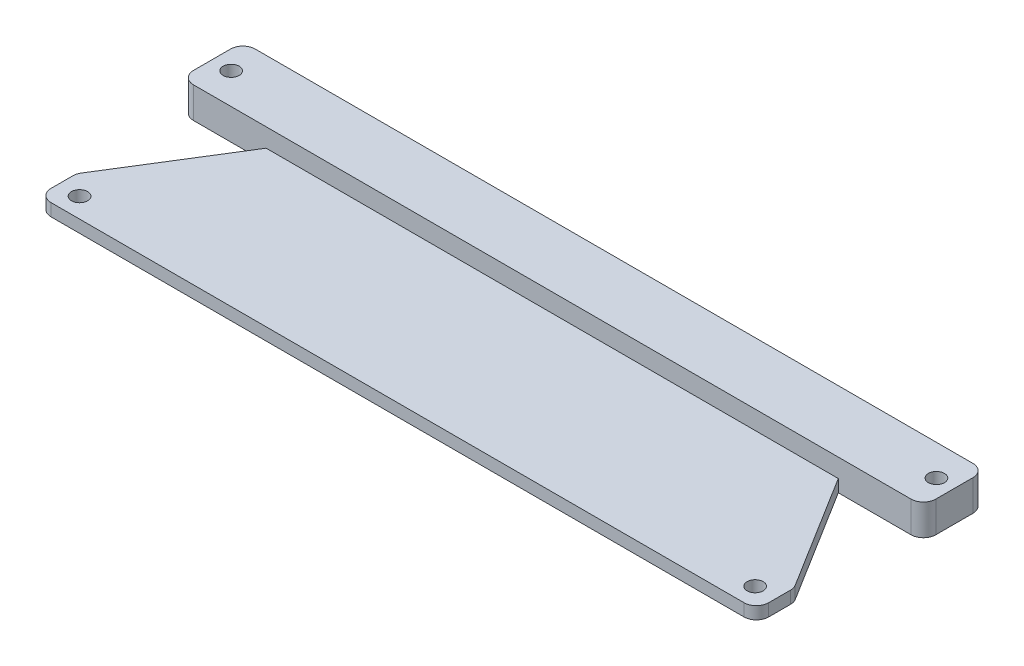
ISO-10303-21;
HEADER;
FILE_DESCRIPTION(('STEP AP214'),'2;1');
FILE_NAME('part.step','',(''),(''),'','','');
FILE_SCHEMA(('AUTOMOTIVE_DESIGN { 1 0 10303 214 1 1 1 1 }'));
ENDSEC;
DATA;
#1=APPLICATION_CONTEXT('core data for automotive mechanical design processes');
#2=APPLICATION_PROTOCOL_DEFINITION('international standard','automotive_design',2000,#1);
#3=PRODUCT_CONTEXT('',#1,'mechanical');
#4=PRODUCT('Part','Part','',(#3));
#5=PRODUCT_RELATED_PRODUCT_CATEGORY('part','',(#4));
#6=PRODUCT_DEFINITION_FORMATION('','',#4);
#7=PRODUCT_DEFINITION_CONTEXT('part definition',#1,'design');
#8=PRODUCT_DEFINITION('design','',#6,#7);
#9=PRODUCT_DEFINITION_SHAPE('','',#8);
#10=(LENGTH_UNIT() NAMED_UNIT(*) SI_UNIT(.MILLI.,.METRE.));
#11=(NAMED_UNIT(*) PLANE_ANGLE_UNIT() SI_UNIT($,.RADIAN.));
#12=(NAMED_UNIT(*) SI_UNIT($,.STERADIAN.) SOLID_ANGLE_UNIT());
#13=UNCERTAINTY_MEASURE_WITH_UNIT(LENGTH_MEASURE(1.E-05),#10,'distance_accuracy_value','');
#14=(GEOMETRIC_REPRESENTATION_CONTEXT(3) GLOBAL_UNCERTAINTY_ASSIGNED_CONTEXT((#13)) GLOBAL_UNIT_ASSIGNED_CONTEXT((#10,
#11,#12)) REPRESENTATION_CONTEXT('',''));
#15=CARTESIAN_POINT('',(0.,0.,0.));
#16=DIRECTION('',(0.,0.,1.));
#17=DIRECTION('',(1.,0.,0.));
#18=AXIS2_PLACEMENT_3D('',#15,#16,#17);
#19=CARTESIAN_POINT('',(0.,0.,0.));
#20=DIRECTION('',(0.,-1.,0.));
#21=DIRECTION('',(-1.,0.,0.));
#22=AXIS2_PLACEMENT_3D('',#19,#20,#21);
#23=PLANE('',#22);
#24=CARTESIAN_POINT('',(69.342,0.,40.386));
#25=DIRECTION('',(0.,-1.,0.));
#26=DIRECTION('',(0.,0.,1.));
#27=AXIS2_PLACEMENT_3D('',#24,#25,#26);
#28=CIRCLE('',#27,1.65100000000001);
#29=CARTESIAN_POINT('',(69.342,0.,42.037));
#30=VERTEX_POINT('',#29);
#31=EDGE_CURVE('E610',#30,#30,#28,.T.);
#32=ORIENTED_EDGE('',*,*,#31,.F.);
#33=EDGE_LOOP('',(#32));
#34=FACE_BOUND('',#33,.T.);
#35=CARTESIAN_POINT('',(-69.342,0.,40.386));
#36=DIRECTION('',(0.,1.,0.));
#37=DIRECTION('',(0.,0.,1.));
#38=AXIS2_PLACEMENT_3D('',#35,#36,#37);
#39=CIRCLE('',#38,1.65100000000001);
#40=CARTESIAN_POINT('',(-69.342,0.,42.037));
#41=VERTEX_POINT('',#40);
#42=EDGE_CURVE('E330',#41,#41,#39,.T.);
#43=ORIENTED_EDGE('',*,*,#42,.T.);
#44=EDGE_LOOP('',(#43));
#45=FACE_BOUND('',#44,.T.);
#46=DIRECTION('',(0.,0.,-1.));
#47=VECTOR('',#46,1.);
#48=CARTESIAN_POINT('',(-73.66,0.,44.45));
#49=LINE('',#48,#47);
#50=CARTESIAN_POINT('',(-73.66,0.,41.91));
#51=VERTEX_POINT('',#50);
#52=CARTESIAN_POINT('',(-73.66,0.,37.4301723546728));
#53=VERTEX_POINT('',#52);
#54=EDGE_CURVE('E202',#51,#53,#49,.T.);
#55=ORIENTED_EDGE('',*,*,#54,.T.);
#56=CARTESIAN_POINT('',(-71.12,0.,37.4301723546728));
#57=DIRECTION('',(0.,-1.,0.));
#58=DIRECTION('',(0.,0.,-1.));
#59=AXIS2_PLACEMENT_3D('',#56,#57,#58);
#60=CIRCLE('',#59,2.54);
#61=CARTESIAN_POINT('',(-73.2767480477236,0.,36.0885174591649));
#62=VERTEX_POINT('',#61);
#63=EDGE_CURVE('E293',#53,#62,#60,.T.);
#64=ORIENTED_EDGE('',*,*,#63,.T.);
#65=DIRECTION('',(-0.528210588782656,0.,0.849113404615591));
#66=VECTOR('',#65,1.);
#67=CARTESIAN_POINT('',(-58.7273810129965,0.,12.7));
#68=LINE('',#67,#66);
#69=CARTESIAN_POINT('',(-58.7273810129965,0.,12.7));
#70=VERTEX_POINT('',#69);
#71=EDGE_CURVE('E189',#70,#62,#68,.T.);
#72=ORIENTED_EDGE('',*,*,#71,.F.);
#73=DIRECTION('',(1.,0.,0.));
#74=VECTOR('',#73,1.);
#75=CARTESIAN_POINT('',(-73.66,0.,12.7));
#76=LINE('',#75,#74);
#77=CARTESIAN_POINT('',(-73.66,0.,12.7));
#78=VERTEX_POINT('',#77);
#79=EDGE_CURVE('E177',#78,#70,#76,.T.);
#80=ORIENTED_EDGE('',*,*,#79,.F.);
#81=CARTESIAN_POINT('',(-73.66,0.,10.16));
#82=DIRECTION('',(0.,-1.,0.));
#83=DIRECTION('',(0.,0.,-1.));
#84=AXIS2_PLACEMENT_3D('',#81,#82,#83);
#85=CIRCLE('',#84,2.54);
#86=CARTESIAN_POINT('',(-76.2,0.,10.16));
#87=VERTEX_POINT('',#86);
#88=EDGE_CURVE('E252',#78,#87,#85,.T.);
#89=ORIENTED_EDGE('',*,*,#88,.T.);
#90=DIRECTION('',(0.,0.,-1.));
#91=VECTOR('',#90,1.);
#92=CARTESIAN_POINT('',(-76.2,0.,12.7));
#93=LINE('',#92,#91);
#94=CARTESIAN_POINT('',(-76.2,0.,2.54));
#95=VERTEX_POINT('',#94);
#96=EDGE_CURVE('E229',#87,#95,#93,.T.);
#97=ORIENTED_EDGE('',*,*,#96,.T.);
#98=CARTESIAN_POINT('',(-73.66,0.,2.54));
#99=DIRECTION('',(0.,-1.,0.));
#100=DIRECTION('',(0.,0.,-1.));
#101=AXIS2_PLACEMENT_3D('',#98,#99,#100);
#102=CIRCLE('',#101,2.54);
#103=CARTESIAN_POINT('',(-73.66,0.,0.));
#104=VERTEX_POINT('',#103);
#105=EDGE_CURVE('E250',#95,#104,#102,.T.);
#106=ORIENTED_EDGE('',*,*,#105,.T.);
#107=DIRECTION('',(1.,0.,0.));
#108=VECTOR('',#107,1.);
#109=CARTESIAN_POINT('',(-76.2,0.,0.));
#110=LINE('',#109,#108);
#111=CARTESIAN_POINT('',(73.6599999999999,0.,0.));
#112=VERTEX_POINT('',#111);
#113=EDGE_CURVE('E241',#104,#112,#110,.T.);
#114=ORIENTED_EDGE('',*,*,#113,.T.);
#115=CARTESIAN_POINT('',(73.66,0.,2.53999999999997));
#116=DIRECTION('',(0.,-1.,0.));
#117=DIRECTION('',(0.,0.,-1.));
#118=AXIS2_PLACEMENT_3D('',#115,#116,#117);
#119=CIRCLE('',#118,2.54);
#120=CARTESIAN_POINT('',(76.2,0.,2.53999999999997));
#121=VERTEX_POINT('',#120);
#122=EDGE_CURVE('E254',#112,#121,#119,.T.);
#123=ORIENTED_EDGE('',*,*,#122,.T.);
#124=DIRECTION('',(0.,0.,1.));
#125=VECTOR('',#124,1.);
#126=CARTESIAN_POINT('',(76.2,0.,0.));
#127=LINE('',#126,#125);
#128=CARTESIAN_POINT('',(76.2,0.,10.16));
#129=VERTEX_POINT('',#128);
#130=EDGE_CURVE('E222',#121,#129,#127,.T.);
#131=ORIENTED_EDGE('',*,*,#130,.T.);
#132=CARTESIAN_POINT('',(73.66,0.,10.16));
#133=DIRECTION('',(0.,-1.,0.));
#134=DIRECTION('',(0.,0.,-1.));
#135=AXIS2_PLACEMENT_3D('',#132,#133,#134);
#136=CIRCLE('',#135,2.54);
#137=CARTESIAN_POINT('',(73.66,0.,12.7));
#138=VERTEX_POINT('',#137);
#139=EDGE_CURVE('E256',#129,#138,#136,.T.);
#140=ORIENTED_EDGE('',*,*,#139,.T.);
#141=DIRECTION('',(-1.,0.,0.));
#142=VECTOR('',#141,1.);
#143=CARTESIAN_POINT('',(73.66,0.,12.7));
#144=LINE('',#143,#142);
#145=CARTESIAN_POINT('',(58.7273810129965,0.,12.7));
#146=VERTEX_POINT('',#145);
#147=EDGE_CURVE('E334',#138,#146,#144,.T.);
#148=ORIENTED_EDGE('',*,*,#147,.T.);
#149=DIRECTION('',(0.528210588782656,0.,0.849113404615591));
#150=VECTOR('',#149,1.);
#151=CARTESIAN_POINT('',(58.7273810129965,0.,12.7));
#152=LINE('',#151,#150);
#153=CARTESIAN_POINT('',(73.2767480477236,0.,36.0885174591649));
#154=VERTEX_POINT('',#153);
#155=EDGE_CURVE('E181',#146,#154,#152,.T.);
#156=ORIENTED_EDGE('',*,*,#155,.T.);
#157=CARTESIAN_POINT('',(71.12,0.,37.4301723546728));
#158=DIRECTION('',(0.,-1.,0.));
#159=DIRECTION('',(0.,0.,-1.));
#160=AXIS2_PLACEMENT_3D('',#157,#158,#159);
#161=CIRCLE('',#160,2.54);
#162=CARTESIAN_POINT('',(73.66,0.,37.4301723546728));
#163=VERTEX_POINT('',#162);
#164=EDGE_CURVE('E291',#154,#163,#161,.T.);
#165=ORIENTED_EDGE('',*,*,#164,.T.);
#166=DIRECTION('',(0.,0.,-1.));
#167=VECTOR('',#166,1.);
#168=CARTESIAN_POINT('',(73.66,0.,44.45));
#169=LINE('',#168,#167);
#170=CARTESIAN_POINT('',(73.66,0.,41.91));
#171=VERTEX_POINT('',#170);
#172=EDGE_CURVE('E210',#171,#163,#169,.T.);
#173=ORIENTED_EDGE('',*,*,#172,.F.);
#174=CARTESIAN_POINT('',(71.12,0.,41.91));
#175=DIRECTION('',(0.,-1.,0.));
#176=DIRECTION('',(0.,0.,-1.));
#177=AXIS2_PLACEMENT_3D('',#174,#175,#176);
#178=CIRCLE('',#177,2.54);
#179=CARTESIAN_POINT('',(71.12,0.,44.45));
#180=VERTEX_POINT('',#179);
#181=EDGE_CURVE('E289',#171,#180,#178,.T.);
#182=ORIENTED_EDGE('',*,*,#181,.T.);
#183=DIRECTION('',(1.,0.,0.));
#184=VECTOR('',#183,1.);
#185=CARTESIAN_POINT('',(-73.66,0.,44.45));
#186=LINE('',#185,#184);
#187=CARTESIAN_POINT('',(-71.12,0.,44.45));
#188=VERTEX_POINT('',#187);
#189=EDGE_CURVE('E193',#188,#180,#186,.T.);
#190=ORIENTED_EDGE('',*,*,#189,.F.);
#191=CARTESIAN_POINT('',(-71.12,0.,41.91));
#192=DIRECTION('',(0.,-1.,0.));
#193=DIRECTION('',(0.,0.,-1.));
#194=AXIS2_PLACEMENT_3D('',#191,#192,#193);
#195=CIRCLE('',#194,2.54);
#196=EDGE_CURVE('E287',#188,#51,#195,.T.);
#197=ORIENTED_EDGE('',*,*,#196,.T.);
#198=EDGE_LOOP('',(#55,#64,#72,#80,#89,#97,#106,#114,#123,#131,#140,#148,#156,#165,#173,#182,
#190,#197));
#199=FACE_BOUND('',#198,.T.);
#200=CARTESIAN_POINT('',(-72.259949664643,0.,6.35));
#201=DIRECTION('',(0.,1.,0.));
#202=DIRECTION('',(0.,0.,1.));
#203=AXIS2_PLACEMENT_3D('',#200,#201,#202);
#204=CIRCLE('',#203,1.65100000000001);
#205=CARTESIAN_POINT('',(-72.259949664643,0.,8.001));
#206=VERTEX_POINT('',#205);
#207=EDGE_CURVE('E213',#206,#206,#204,.T.);
#208=ORIENTED_EDGE('',*,*,#207,.T.);
#209=EDGE_LOOP('',(#208));
#210=FACE_BOUND('',#209,.T.);
#211=CARTESIAN_POINT('',(72.5200503353569,0.,6.34999999999997));
#212=DIRECTION('',(0.,1.,0.));
#213=DIRECTION('',(0.,0.,1.));
#214=AXIS2_PLACEMENT_3D('',#211,#212,#213);
#215=CIRCLE('',#214,1.65100000000001);
#216=CARTESIAN_POINT('',(72.5200503353569,0.,8.00099999999998));
#217=VERTEX_POINT('',#216);
#218=EDGE_CURVE('E219',#217,#217,#215,.T.);
#219=ORIENTED_EDGE('',*,*,#218,.T.);
#220=EDGE_LOOP('',(#219));
#221=FACE_BOUND('',#220,.T.);
#222=ADVANCED_FACE('F44',(#34,#45,#199,#210,#221),#23,.T.);
#223=CARTESIAN_POINT('',(73.66,2.54,44.45));
#224=DIRECTION('',(1.,0.,0.));
#225=DIRECTION('',(0.,1.,0.));
#226=AXIS2_PLACEMENT_3D('',#223,#224,#225);
#227=PLANE('',#226);
#228=ORIENTED_EDGE('',*,*,#172,.T.);
#229=DIRECTION('',(0.,-1.,0.));
#230=VECTOR('',#229,1.);
#231=CARTESIAN_POINT('',(73.66,2.54000000000006,37.4301723546728));
#232=LINE('',#231,#230);
#233=CARTESIAN_POINT('',(73.66,2.54,37.4301723546728));
#234=VERTEX_POINT('',#233);
#235=EDGE_CURVE('E67',#163,#234,#232,.F.);
#236=ORIENTED_EDGE('',*,*,#235,.T.);
#237=DIRECTION('',(0.,0.,-1.));
#238=VECTOR('',#237,1.);
#239=CARTESIAN_POINT('',(73.66,2.54,44.45));
#240=LINE('',#239,#238);
#241=CARTESIAN_POINT('',(73.66,2.54,41.91));
#242=VERTEX_POINT('',#241);
#243=EDGE_CURVE('E208',#242,#234,#240,.T.);
#244=ORIENTED_EDGE('',*,*,#243,.F.);
#245=DIRECTION('',(0.,-1.,0.));
#246=VECTOR('',#245,1.);
#247=CARTESIAN_POINT('',(73.66,0.,41.91));
#248=LINE('',#247,#246);
#249=EDGE_CURVE('E306',#242,#171,#248,.T.);
#250=ORIENTED_EDGE('',*,*,#249,.T.);
#251=EDGE_LOOP('',(#228,#236,#244,#250));
#252=FACE_BOUND('',#251,.T.);
#253=ADVANCED_FACE('F346',(#252),#227,.T.);
#254=CARTESIAN_POINT('',(-73.66,2.54,44.45));
#255=DIRECTION('',(0.,1.,0.));
#256=DIRECTION('',(0.,0.,1.));
#257=AXIS2_PLACEMENT_3D('',#254,#255,#256);
#258=PLANE('',#257);
#259=CARTESIAN_POINT('',(69.342,2.54,40.386));
#260=DIRECTION('',(0.,-1.,0.));
#261=DIRECTION('',(0.,0.,1.));
#262=AXIS2_PLACEMENT_3D('',#259,#260,#261);
#263=CIRCLE('',#262,1.65100000000001);
#264=CARTESIAN_POINT('',(69.342,2.54,42.037));
#265=VERTEX_POINT('',#264);
#266=EDGE_CURVE('E614',#265,#265,#263,.T.);
#267=ORIENTED_EDGE('',*,*,#266,.T.);
#268=EDGE_LOOP('',(#267));
#269=FACE_BOUND('',#268,.T.);
#270=CARTESIAN_POINT('',(-69.342,2.54,40.386));
#271=DIRECTION('',(0.,1.,0.));
#272=DIRECTION('',(0.,0.,1.));
#273=AXIS2_PLACEMENT_3D('',#270,#271,#272);
#274=CIRCLE('',#273,1.65100000000001);
#275=CARTESIAN_POINT('',(-69.342,2.54,42.037));
#276=VERTEX_POINT('',#275);
#277=EDGE_CURVE('E608',#276,#276,#274,.T.);
#278=ORIENTED_EDGE('',*,*,#277,.F.);
#279=EDGE_LOOP('',(#278));
#280=FACE_BOUND('',#279,.T.);
#281=DIRECTION('',(-0.528210588782656,0.,0.849113404615591));
#282=VECTOR('',#281,1.);
#283=CARTESIAN_POINT('',(-58.7273810129965,2.54,12.7));
#284=LINE('',#283,#282);
#285=CARTESIAN_POINT('',(-58.7273810129965,2.54,12.7));
#286=VERTEX_POINT('',#285);
#287=CARTESIAN_POINT('',(-73.2767480477236,2.54,36.0885174591649));
#288=VERTEX_POINT('',#287);
#289=EDGE_CURVE('E182',#286,#288,#284,.T.);
#290=ORIENTED_EDGE('',*,*,#289,.T.);
#291=CARTESIAN_POINT('',(-71.12,2.54,37.4301723546728));
#292=DIRECTION('',(0.,1.,0.));
#293=DIRECTION('',(0.,0.,1.));
#294=AXIS2_PLACEMENT_3D('',#291,#292,#293);
#295=CIRCLE('',#294,2.54);
#296=CARTESIAN_POINT('',(-73.66,2.54,37.4301723546728));
#297=VERTEX_POINT('',#296);
#298=EDGE_CURVE('E301',#288,#297,#295,.T.);
#299=ORIENTED_EDGE('',*,*,#298,.T.);
#300=DIRECTION('',(0.,0.,-1.));
#301=VECTOR('',#300,1.);
#302=CARTESIAN_POINT('',(-73.66,2.54,44.45));
#303=LINE('',#302,#301);
#304=CARTESIAN_POINT('',(-73.66,2.54,41.91));
#305=VERTEX_POINT('',#304);
#306=EDGE_CURVE('E205',#305,#297,#303,.T.);
#307=ORIENTED_EDGE('',*,*,#306,.F.);
#308=CARTESIAN_POINT('',(-71.12,2.54,41.91));
#309=DIRECTION('',(0.,1.,0.));
#310=DIRECTION('',(0.,0.,1.));
#311=AXIS2_PLACEMENT_3D('',#308,#309,#310);
#312=CIRCLE('',#311,2.54);
#313=CARTESIAN_POINT('',(-71.12,2.54,44.45));
#314=VERTEX_POINT('',#313);
#315=EDGE_CURVE('E296',#305,#314,#312,.T.);
#316=ORIENTED_EDGE('',*,*,#315,.T.);
#317=DIRECTION('',(1.,0.,0.));
#318=VECTOR('',#317,1.);
#319=CARTESIAN_POINT('',(-73.66,2.54,44.45));
#320=LINE('',#319,#318);
#321=CARTESIAN_POINT('',(71.12,2.54,44.45));
#322=VERTEX_POINT('',#321);
#323=EDGE_CURVE('E197',#314,#322,#320,.T.);
#324=ORIENTED_EDGE('',*,*,#323,.T.);
#325=CARTESIAN_POINT('',(71.12,2.54,41.91));
#326=DIRECTION('',(0.,1.,0.));
#327=DIRECTION('',(0.,0.,1.));
#328=AXIS2_PLACEMENT_3D('',#325,#326,#327);
#329=CIRCLE('',#328,2.54);
#330=EDGE_CURVE('E298',#322,#242,#329,.T.);
#331=ORIENTED_EDGE('',*,*,#330,.T.);
#332=ORIENTED_EDGE('',*,*,#243,.T.);
#333=CARTESIAN_POINT('',(71.12,2.54,37.4301723546728));
#334=DIRECTION('',(0.,1.,0.));
#335=DIRECTION('',(0.,0.,1.));
#336=AXIS2_PLACEMENT_3D('',#333,#334,#335);
#337=CIRCLE('',#336,2.54);
#338=CARTESIAN_POINT('',(73.2767480477236,2.54,36.0885174591649));
#339=VERTEX_POINT('',#338);
#340=EDGE_CURVE('E59',#234,#339,#337,.T.);
#341=ORIENTED_EDGE('',*,*,#340,.T.);
#342=DIRECTION('',(0.528210588782656,0.,0.849113404615591));
#343=VECTOR('',#342,1.);
#344=CARTESIAN_POINT('',(58.7273810129965,2.54,12.7));
#345=LINE('',#344,#343);
#346=CARTESIAN_POINT('',(58.7273810129965,2.54,12.7));
#347=VERTEX_POINT('',#346);
#348=EDGE_CURVE('E192',#347,#339,#345,.T.);
#349=ORIENTED_EDGE('',*,*,#348,.F.);
#350=DIRECTION('',(1.,0.,0.));
#351=VECTOR('',#350,1.);
#352=CARTESIAN_POINT('',(-73.66,2.54,12.7));
#353=LINE('',#352,#351);
#354=EDGE_CURVE('E174',#286,#347,#353,.T.);
#355=ORIENTED_EDGE('',*,*,#354,.F.);
#356=EDGE_LOOP('',(#290,#299,#307,#316,#324,#331,#332,#341,#349,#355));
#357=FACE_BOUND('',#356,.T.);
#358=ADVANCED_FACE('F191',(#269,#280,#357),#258,.T.);
#359=CARTESIAN_POINT('',(-76.2,6.35,12.7));
#360=DIRECTION('',(0.,0.,-1.));
#361=DIRECTION('',(-1.,0.,0.));
#362=AXIS2_PLACEMENT_3D('',#359,#360,#361);
#363=PLANE('',#362);
#364=DIRECTION('',(0.,-1.,0.));
#365=VECTOR('',#364,1.);
#366=CARTESIAN_POINT('',(-73.66,0.,12.7));
#367=LINE('',#366,#365);
#368=CARTESIAN_POINT('',(-73.66,6.35,12.7));
#369=VERTEX_POINT('',#368);
#370=EDGE_CURVE('E259',#369,#78,#367,.T.);
#371=ORIENTED_EDGE('',*,*,#370,.T.);
#372=ORIENTED_EDGE('',*,*,#79,.T.);
#373=DIRECTION('',(0.,-1.,0.));
#374=VECTOR('',#373,1.);
#375=CARTESIAN_POINT('',(-58.7273810129965,2.54,12.7));
#376=LINE('',#375,#374);
#377=EDGE_CURVE('E170',#286,#70,#376,.T.);
#378=ORIENTED_EDGE('',*,*,#377,.F.);
#379=ORIENTED_EDGE('',*,*,#354,.T.);
#380=DIRECTION('',(0.,-1.,0.));
#381=VECTOR('',#380,1.);
#382=CARTESIAN_POINT('',(58.7273810129965,2.54,12.7));
#383=LINE('',#382,#381);
#384=EDGE_CURVE('E194',#347,#146,#383,.T.);
#385=ORIENTED_EDGE('',*,*,#384,.T.);
#386=ORIENTED_EDGE('',*,*,#147,.F.);
#387=DIRECTION('',(0.,-1.,0.));
#388=VECTOR('',#387,1.);
#389=CARTESIAN_POINT('',(73.66,6.35,12.7));
#390=LINE('',#389,#388);
#391=CARTESIAN_POINT('',(73.66,6.35,12.7));
#392=VERTEX_POINT('',#391);
#393=EDGE_CURVE('E261',#138,#392,#390,.F.);
#394=ORIENTED_EDGE('',*,*,#393,.T.);
#395=DIRECTION('',(1.,0.,0.));
#396=VECTOR('',#395,1.);
#397=CARTESIAN_POINT('',(-76.2,6.35,12.7));
#398=LINE('',#397,#396);
#399=EDGE_CURVE('E225',#369,#392,#398,.T.);
#400=ORIENTED_EDGE('',*,*,#399,.F.);
#401=EDGE_LOOP('',(#371,#372,#378,#379,#385,#386,#394,#400));
#402=FACE_BOUND('',#401,.T.);
#403=ADVANCED_FACE('F172',(#402),#363,.F.);
#404=CARTESIAN_POINT('',(76.2,6.35,0.));
#405=DIRECTION('',(1.,0.,0.));
#406=DIRECTION('',(0.,0.,-1.));
#407=AXIS2_PLACEMENT_3D('',#404,#405,#406);
#408=PLANE('',#407);
#409=DIRECTION('',(0.,0.,1.));
#410=VECTOR('',#409,1.);
#411=CARTESIAN_POINT('',(76.2,6.35,0.));
#412=LINE('',#411,#410);
#413=CARTESIAN_POINT('',(76.2,6.35,2.53999999999997));
#414=VERTEX_POINT('',#413);
#415=CARTESIAN_POINT('',(76.2,6.35,10.16));
#416=VERTEX_POINT('',#415);
#417=EDGE_CURVE('E228',#414,#416,#412,.T.);
#418=ORIENTED_EDGE('',*,*,#417,.T.);
#419=DIRECTION('',(0.,-1.,0.));
#420=VECTOR('',#419,1.);
#421=CARTESIAN_POINT('',(76.2,0.,10.16));
#422=LINE('',#421,#420);
#423=EDGE_CURVE('E247',#416,#129,#422,.T.);
#424=ORIENTED_EDGE('',*,*,#423,.T.);
#425=ORIENTED_EDGE('',*,*,#130,.F.);
#426=DIRECTION('',(0.,-1.,0.));
#427=VECTOR('',#426,1.);
#428=CARTESIAN_POINT('',(76.2,6.35,2.53999999999997));
#429=LINE('',#428,#427);
#430=EDGE_CURVE('E238',#121,#414,#429,.F.);
#431=ORIENTED_EDGE('',*,*,#430,.T.);
#432=EDGE_LOOP('',(#418,#424,#425,#431));
#433=FACE_BOUND('',#432,.T.);
#434=ADVANCED_FACE('F380',(#433),#408,.T.);
#435=CARTESIAN_POINT('',(-76.2,6.35,0.));
#436=DIRECTION('',(0.,0.,-1.));
#437=DIRECTION('',(-1.,0.,0.));
#438=AXIS2_PLACEMENT_3D('',#435,#436,#437);
#439=PLANE('',#438);
#440=DIRECTION('',(1.,0.,0.));
#441=VECTOR('',#440,1.);
#442=CARTESIAN_POINT('',(-76.2,6.35,0.));
#443=LINE('',#442,#441);
#444=CARTESIAN_POINT('',(-73.66,6.35,0.));
#445=VERTEX_POINT('',#444);
#446=CARTESIAN_POINT('',(73.6599999999999,6.35,0.));
#447=VERTEX_POINT('',#446);
#448=EDGE_CURVE('E232',#445,#447,#443,.T.);
#449=ORIENTED_EDGE('',*,*,#448,.T.);
#450=DIRECTION('',(0.,-1.,0.));
#451=VECTOR('',#450,1.);
#452=CARTESIAN_POINT('',(73.66,6.35,0.));
#453=LINE('',#452,#451);
#454=EDGE_CURVE('E273',#447,#112,#453,.T.);
#455=ORIENTED_EDGE('',*,*,#454,.T.);
#456=ORIENTED_EDGE('',*,*,#113,.F.);
#457=DIRECTION('',(0.,-1.,0.));
#458=VECTOR('',#457,1.);
#459=CARTESIAN_POINT('',(-73.66,6.35,0.));
#460=LINE('',#459,#458);
#461=EDGE_CURVE('E271',#104,#445,#460,.F.);
#462=ORIENTED_EDGE('',*,*,#461,.T.);
#463=EDGE_LOOP('',(#449,#455,#456,#462));
#464=FACE_BOUND('',#463,.T.);
#465=ADVANCED_FACE('F376',(#464),#439,.T.);
#466=CARTESIAN_POINT('',(-76.2,6.35,12.7));
#467=DIRECTION('',(-1.,0.,0.));
#468=DIRECTION('',(0.,0.,1.));
#469=AXIS2_PLACEMENT_3D('',#466,#467,#468);
#470=PLANE('',#469);
#471=ORIENTED_EDGE('',*,*,#96,.F.);
#472=DIRECTION('',(0.,-1.,0.));
#473=VECTOR('',#472,1.);
#474=CARTESIAN_POINT('',(-76.2,6.35,10.16));
#475=LINE('',#474,#473);
#476=CARTESIAN_POINT('',(-76.2,6.35,10.16));
#477=VERTEX_POINT('',#476);
#478=EDGE_CURVE('E279',#87,#477,#475,.F.);
#479=ORIENTED_EDGE('',*,*,#478,.T.);
#480=DIRECTION('',(0.,0.,-1.));
#481=VECTOR('',#480,1.);
#482=CARTESIAN_POINT('',(-76.2,6.35,12.7));
#483=LINE('',#482,#481);
#484=CARTESIAN_POINT('',(-76.2,6.35,2.54));
#485=VERTEX_POINT('',#484);
#486=EDGE_CURVE('E235',#477,#485,#483,.T.);
#487=ORIENTED_EDGE('',*,*,#486,.T.);
#488=DIRECTION('',(0.,-1.,0.));
#489=VECTOR('',#488,1.);
#490=CARTESIAN_POINT('',(-76.2,6.35,2.54));
#491=LINE('',#490,#489);
#492=EDGE_CURVE('E276',#485,#95,#491,.T.);
#493=ORIENTED_EDGE('',*,*,#492,.T.);
#494=EDGE_LOOP('',(#471,#479,#487,#493));
#495=FACE_BOUND('',#494,.T.);
#496=ADVANCED_FACE('F373',(#495),#470,.T.);
#497=CARTESIAN_POINT('',(0.,6.35,0.));
#498=DIRECTION('',(0.,-1.,0.));
#499=DIRECTION('',(-1.,0.,0.));
#500=AXIS2_PLACEMENT_3D('',#497,#498,#499);
#501=PLANE('',#500);
#502=CARTESIAN_POINT('',(-72.259949664643,6.35,6.35));
#503=DIRECTION('',(0.,1.,0.));
#504=DIRECTION('',(0.,0.,1.));
#505=AXIS2_PLACEMENT_3D('',#502,#503,#504);
#506=CIRCLE('',#505,1.65100000000001);
#507=CARTESIAN_POINT('',(-72.259949664643,6.35,8.001));
#508=VERTEX_POINT('',#507);
#509=EDGE_CURVE('E212',#508,#508,#506,.T.);
#510=ORIENTED_EDGE('',*,*,#509,.F.);
#511=EDGE_LOOP('',(#510));
#512=FACE_BOUND('',#511,.T.);
#513=CARTESIAN_POINT('',(72.5200503353569,6.35,6.34999999999997));
#514=DIRECTION('',(0.,1.,0.));
#515=DIRECTION('',(0.,0.,1.));
#516=AXIS2_PLACEMENT_3D('',#513,#514,#515);
#517=CIRCLE('',#516,1.65100000000001);
#518=CARTESIAN_POINT('',(72.5200503353569,6.35,8.00099999999998));
#519=VERTEX_POINT('',#518);
#520=EDGE_CURVE('E216',#519,#519,#517,.T.);
#521=ORIENTED_EDGE('',*,*,#520,.F.);
#522=EDGE_LOOP('',(#521));
#523=FACE_BOUND('',#522,.T.);
#524=ORIENTED_EDGE('',*,*,#399,.T.);
#525=CARTESIAN_POINT('',(73.66,6.35,10.16));
#526=DIRECTION('',(0.,-1.,0.));
#527=DIRECTION('',(0.,0.,-1.));
#528=AXIS2_PLACEMENT_3D('',#525,#526,#527);
#529=CIRCLE('',#528,2.54);
#530=EDGE_CURVE('E269',#392,#416,#529,.F.);
#531=ORIENTED_EDGE('',*,*,#530,.T.);
#532=ORIENTED_EDGE('',*,*,#417,.F.);
#533=CARTESIAN_POINT('',(73.66,6.35,2.53999999999997));
#534=DIRECTION('',(0.,-1.,0.));
#535=DIRECTION('',(0.,0.,-1.));
#536=AXIS2_PLACEMENT_3D('',#533,#534,#535);
#537=CIRCLE('',#536,2.54);
#538=EDGE_CURVE('E267',#414,#447,#537,.F.);
#539=ORIENTED_EDGE('',*,*,#538,.T.);
#540=ORIENTED_EDGE('',*,*,#448,.F.);
#541=CARTESIAN_POINT('',(-73.66,6.35,2.54));
#542=DIRECTION('',(0.,-1.,0.));
#543=DIRECTION('',(0.,0.,-1.));
#544=AXIS2_PLACEMENT_3D('',#541,#542,#543);
#545=CIRCLE('',#544,2.54);
#546=EDGE_CURVE('E263',#445,#485,#545,.F.);
#547=ORIENTED_EDGE('',*,*,#546,.T.);
#548=ORIENTED_EDGE('',*,*,#486,.F.);
#549=CARTESIAN_POINT('',(-73.66,6.35,10.16));
#550=DIRECTION('',(0.,-1.,0.));
#551=DIRECTION('',(0.,0.,-1.));
#552=AXIS2_PLACEMENT_3D('',#549,#550,#551);
#553=CIRCLE('',#552,2.54);
#554=EDGE_CURVE('E265',#477,#369,#553,.F.);
#555=ORIENTED_EDGE('',*,*,#554,.T.);
#556=EDGE_LOOP('',(#524,#531,#532,#539,#540,#547,#548,#555));
#557=FACE_BOUND('',#556,.T.);
#558=ADVANCED_FACE('F371',(#512,#523,#557),#501,.F.);
#559=CARTESIAN_POINT('',(73.66,6.35,10.16));
#560=DIRECTION('',(0.,1.,0.));
#561=DIRECTION('',(0.,0.,1.));
#562=AXIS2_PLACEMENT_3D('',#559,#560,#561);
#563=CYLINDRICAL_SURFACE('',#562,2.54);
#564=ORIENTED_EDGE('',*,*,#530,.F.);
#565=ORIENTED_EDGE('',*,*,#393,.F.);
#566=ORIENTED_EDGE('',*,*,#139,.F.);
#567=ORIENTED_EDGE('',*,*,#423,.F.);
#568=EDGE_LOOP('',(#564,#565,#566,#567));
#569=FACE_BOUND('',#568,.T.);
#570=ADVANCED_FACE('F387',(#569),#563,.T.);
#571=CARTESIAN_POINT('',(73.66,6.35,2.53999999999997));
#572=DIRECTION('',(0.,-1.,0.));
#573=DIRECTION('',(0.,0.,-1.));
#574=AXIS2_PLACEMENT_3D('',#571,#572,#573);
#575=CYLINDRICAL_SURFACE('',#574,2.54);
#576=ORIENTED_EDGE('',*,*,#538,.F.);
#577=ORIENTED_EDGE('',*,*,#430,.F.);
#578=ORIENTED_EDGE('',*,*,#122,.F.);
#579=ORIENTED_EDGE('',*,*,#454,.F.);
#580=EDGE_LOOP('',(#576,#577,#578,#579));
#581=FACE_BOUND('',#580,.T.);
#582=ADVANCED_FACE('F390',(#581),#575,.T.);
#583=CARTESIAN_POINT('',(-73.66,6.35,10.16));
#584=DIRECTION('',(0.,1.,0.));
#585=DIRECTION('',(0.,0.,1.));
#586=AXIS2_PLACEMENT_3D('',#583,#584,#585);
#587=CYLINDRICAL_SURFACE('',#586,2.54);
#588=ORIENTED_EDGE('',*,*,#554,.F.);
#589=ORIENTED_EDGE('',*,*,#478,.F.);
#590=ORIENTED_EDGE('',*,*,#88,.F.);
#591=ORIENTED_EDGE('',*,*,#370,.F.);
#592=EDGE_LOOP('',(#588,#589,#590,#591));
#593=FACE_BOUND('',#592,.T.);
#594=ADVANCED_FACE('F394',(#593),#587,.T.);
#595=CARTESIAN_POINT('',(-73.66,6.35,2.54));
#596=DIRECTION('',(0.,-1.,0.));
#597=DIRECTION('',(0.,0.,-1.));
#598=AXIS2_PLACEMENT_3D('',#595,#596,#597);
#599=CYLINDRICAL_SURFACE('',#598,2.54);
#600=ORIENTED_EDGE('',*,*,#546,.F.);
#601=ORIENTED_EDGE('',*,*,#461,.F.);
#602=ORIENTED_EDGE('',*,*,#105,.F.);
#603=ORIENTED_EDGE('',*,*,#492,.F.);
#604=EDGE_LOOP('',(#600,#601,#602,#603));
#605=FACE_BOUND('',#604,.T.);
#606=ADVANCED_FACE('F398',(#605),#599,.T.);
#607=CARTESIAN_POINT('',(72.5200503353569,0.,6.34999999999997));
#608=DIRECTION('',(0.,1.,0.));
#609=DIRECTION('',(0.,0.,1.));
#610=AXIS2_PLACEMENT_3D('',#607,#608,#609);
#611=CYLINDRICAL_SURFACE('',#610,1.65100000000001);
#612=ORIENTED_EDGE('',*,*,#218,.F.);
#613=EDGE_LOOP('',(#612));
#614=FACE_BOUND('',#613,.T.);
#615=ORIENTED_EDGE('',*,*,#520,.T.);
#616=EDGE_LOOP('',(#615));
#617=FACE_BOUND('',#616,.T.);
#618=ADVANCED_FACE('F402',(#614,#617),#611,.F.);
#619=CARTESIAN_POINT('',(-72.259949664643,0.,6.35));
#620=DIRECTION('',(0.,1.,0.));
#621=DIRECTION('',(0.,0.,1.));
#622=AXIS2_PLACEMENT_3D('',#619,#620,#621);
#623=CYLINDRICAL_SURFACE('',#622,1.65100000000001);
#624=ORIENTED_EDGE('',*,*,#207,.F.);
#625=EDGE_LOOP('',(#624));
#626=FACE_BOUND('',#625,.T.);
#627=ORIENTED_EDGE('',*,*,#509,.T.);
#628=EDGE_LOOP('',(#627));
#629=FACE_BOUND('',#628,.T.);
#630=ADVANCED_FACE('F420',(#626,#629),#623,.F.);
#631=CARTESIAN_POINT('',(-73.66,0.,44.45));
#632=DIRECTION('',(-1.,0.,0.));
#633=DIRECTION('',(0.,0.,1.));
#634=AXIS2_PLACEMENT_3D('',#631,#632,#633);
#635=PLANE('',#634);
#636=ORIENTED_EDGE('',*,*,#306,.T.);
#637=DIRECTION('',(0.,-1.,0.));
#638=VECTOR('',#637,1.);
#639=CARTESIAN_POINT('',(-73.66,0.,37.4301723546728));
#640=LINE('',#639,#638);
#641=EDGE_CURVE('E284',#297,#53,#640,.T.);
#642=ORIENTED_EDGE('',*,*,#641,.T.);
#643=ORIENTED_EDGE('',*,*,#54,.F.);
#644=DIRECTION('',(0.,1.,0.));
#645=VECTOR('',#644,1.);
#646=CARTESIAN_POINT('',(-73.66,2.54,41.91));
#647=LINE('',#646,#645);
#648=EDGE_CURVE('E281',#51,#305,#647,.T.);
#649=ORIENTED_EDGE('',*,*,#648,.T.);
#650=EDGE_LOOP('',(#636,#642,#643,#649));
#651=FACE_BOUND('',#650,.T.);
#652=ADVANCED_FACE('F325',(#651),#635,.T.);
#653=CARTESIAN_POINT('',(0.,0.,44.45));
#654=DIRECTION('',(0.,0.,-1.));
#655=DIRECTION('',(-1.,0.,0.));
#656=AXIS2_PLACEMENT_3D('',#653,#654,#655);
#657=PLANE('',#656);
#658=ORIENTED_EDGE('',*,*,#189,.T.);
#659=DIRECTION('',(0.,-1.,0.));
#660=VECTOR('',#659,1.);
#661=CARTESIAN_POINT('',(71.12,2.54000000000001,44.45));
#662=LINE('',#661,#660);
#663=EDGE_CURVE('E11',#180,#322,#662,.F.);
#664=ORIENTED_EDGE('',*,*,#663,.T.);
#665=ORIENTED_EDGE('',*,*,#323,.F.);
#666=DIRECTION('',(0.,1.,0.));
#667=VECTOR('',#666,1.);
#668=CARTESIAN_POINT('',(-71.12,0.,44.45));
#669=LINE('',#668,#667);
#670=EDGE_CURVE('E52',#314,#188,#669,.F.);
#671=ORIENTED_EDGE('',*,*,#670,.T.);
#672=EDGE_LOOP('',(#658,#664,#665,#671));
#673=FACE_BOUND('',#672,.T.);
#674=ADVANCED_FACE('F313',(#673),#657,.F.);
#675=CARTESIAN_POINT('',(58.7273810129965,2.54,12.7));
#676=DIRECTION('',(0.849113404615591,0.,-0.528210588782656));
#677=DIRECTION('',(-0.528210588782656,0.,-0.849113404615591));
#678=AXIS2_PLACEMENT_3D('',#675,#676,#677);
#679=PLANE('',#678);
#680=ORIENTED_EDGE('',*,*,#348,.T.);
#681=DIRECTION('',(0.,-1.,0.));
#682=VECTOR('',#681,1.);
#683=CARTESIAN_POINT('',(73.2767480477236,2.53999999999972,36.0885174591649));
#684=LINE('',#683,#682);
#685=EDGE_CURVE('E303',#339,#154,#684,.T.);
#686=ORIENTED_EDGE('',*,*,#685,.T.);
#687=ORIENTED_EDGE('',*,*,#155,.F.);
#688=ORIENTED_EDGE('',*,*,#384,.F.);
#689=EDGE_LOOP('',(#680,#686,#687,#688));
#690=FACE_BOUND('',#689,.T.);
#691=ADVANCED_FACE('F342',(#690),#679,.T.);
#692=CARTESIAN_POINT('',(-58.7273810129965,2.54,12.7));
#693=DIRECTION('',(0.849113404615591,0.,0.528210588782656));
#694=DIRECTION('',(0.528210588782656,0.,-0.849113404615591));
#695=AXIS2_PLACEMENT_3D('',#692,#693,#694);
#696=PLANE('',#695);
#697=ORIENTED_EDGE('',*,*,#71,.T.);
#698=DIRECTION('',(0.,-1.,0.));
#699=VECTOR('',#698,1.);
#700=CARTESIAN_POINT('',(-73.2767480477236,2.54,36.0885174591649));
#701=LINE('',#700,#699);
#702=EDGE_CURVE('E187',#62,#288,#701,.F.);
#703=ORIENTED_EDGE('',*,*,#702,.T.);
#704=ORIENTED_EDGE('',*,*,#289,.F.);
#705=ORIENTED_EDGE('',*,*,#377,.T.);
#706=EDGE_LOOP('',(#697,#703,#704,#705));
#707=FACE_BOUND('',#706,.T.);
#708=ADVANCED_FACE('F185',(#707),#696,.F.);
#709=CARTESIAN_POINT('',(-71.12,0.,37.4301723546728));
#710=DIRECTION('',(0.,1.,0.));
#711=DIRECTION('',(0.,0.,1.));
#712=AXIS2_PLACEMENT_3D('',#709,#710,#711);
#713=CYLINDRICAL_SURFACE('',#712,2.54);
#714=ORIENTED_EDGE('',*,*,#298,.F.);
#715=ORIENTED_EDGE('',*,*,#702,.F.);
#716=ORIENTED_EDGE('',*,*,#63,.F.);
#717=ORIENTED_EDGE('',*,*,#641,.F.);
#718=EDGE_LOOP('',(#714,#715,#716,#717));
#719=FACE_BOUND('',#718,.T.);
#720=ADVANCED_FACE('F328',(#719),#713,.T.);
#721=CARTESIAN_POINT('',(71.12,2.53999999999972,37.4301723546728));
#722=DIRECTION('',(0.,-1.,0.));
#723=DIRECTION('',(0.,0.,-1.));
#724=AXIS2_PLACEMENT_3D('',#721,#722,#723);
#725=CYLINDRICAL_SURFACE('',#724,2.54);
#726=ORIENTED_EDGE('',*,*,#340,.F.);
#727=ORIENTED_EDGE('',*,*,#235,.F.);
#728=ORIENTED_EDGE('',*,*,#164,.F.);
#729=ORIENTED_EDGE('',*,*,#685,.F.);
#730=EDGE_LOOP('',(#726,#727,#728,#729));
#731=FACE_BOUND('',#730,.T.);
#732=ADVANCED_FACE('F345',(#731),#725,.T.);
#733=CARTESIAN_POINT('',(71.12,2.54000000000001,41.91));
#734=DIRECTION('',(0.,1.,0.));
#735=DIRECTION('',(-1.,0.,0.));
#736=AXIS2_PLACEMENT_3D('',#733,#734,#735);
#737=CYLINDRICAL_SURFACE('',#736,2.54);
#738=ORIENTED_EDGE('',*,*,#330,.F.);
#739=ORIENTED_EDGE('',*,*,#663,.F.);
#740=ORIENTED_EDGE('',*,*,#181,.F.);
#741=ORIENTED_EDGE('',*,*,#249,.F.);
#742=EDGE_LOOP('',(#738,#739,#740,#741));
#743=FACE_BOUND('',#742,.T.);
#744=ADVANCED_FACE('F350',(#743),#737,.T.);
#745=CARTESIAN_POINT('',(-71.12,0.,41.91));
#746=DIRECTION('',(0.,-1.,0.));
#747=DIRECTION('',(0.,0.,-1.));
#748=AXIS2_PLACEMENT_3D('',#745,#746,#747);
#749=CYLINDRICAL_SURFACE('',#748,2.54);
#750=ORIENTED_EDGE('',*,*,#196,.F.);
#751=ORIENTED_EDGE('',*,*,#670,.F.);
#752=ORIENTED_EDGE('',*,*,#315,.F.);
#753=ORIENTED_EDGE('',*,*,#648,.F.);
#754=EDGE_LOOP('',(#750,#751,#752,#753));
#755=FACE_BOUND('',#754,.T.);
#756=ADVANCED_FACE('F46',(#755),#749,.T.);
#757=CARTESIAN_POINT('',(-69.342,0.,40.386));
#758=DIRECTION('',(0.,1.,0.));
#759=DIRECTION('',(0.,0.,1.));
#760=AXIS2_PLACEMENT_3D('',#757,#758,#759);
#761=CYLINDRICAL_SURFACE('',#760,1.65100000000001);
#762=ORIENTED_EDGE('',*,*,#42,.F.);
#763=EDGE_LOOP('',(#762));
#764=FACE_BOUND('',#763,.T.);
#765=ORIENTED_EDGE('',*,*,#277,.T.);
#766=EDGE_LOOP('',(#765));
#767=FACE_BOUND('',#766,.T.);
#768=ADVANCED_FACE('F356',(#764,#767),#761,.F.);
#769=CARTESIAN_POINT('',(69.342,0.,40.386));
#770=DIRECTION('',(0.,1.,0.));
#771=DIRECTION('',(0.,0.,1.));
#772=AXIS2_PLACEMENT_3D('',#769,#770,#771);
#773=CYLINDRICAL_SURFACE('',#772,1.65100000000001);
#774=ORIENTED_EDGE('',*,*,#31,.T.);
#775=EDGE_LOOP('',(#774));
#776=FACE_BOUND('',#775,.T.);
#777=ORIENTED_EDGE('',*,*,#266,.F.);
#778=EDGE_LOOP('',(#777));
#779=FACE_BOUND('',#778,.T.);
#780=ADVANCED_FACE('F565',(#776,#779),#773,.F.);
#781=CLOSED_SHELL('',(#222,#253,#358,#403,#434,#465,#496,#558,#570,#582,#594,#606,#618,#630,
#652,#674,#691,#708,#720,#732,#744,#756,#768,#780));
#782=MANIFOLD_SOLID_BREP('B2',#781);
#783=ADVANCED_BREP_SHAPE_REPRESENTATION('',(#18,#782),#14);
#784=SHAPE_DEFINITION_REPRESENTATION(#9,#783);
ENDSEC;
END-ISO-10303-21;
